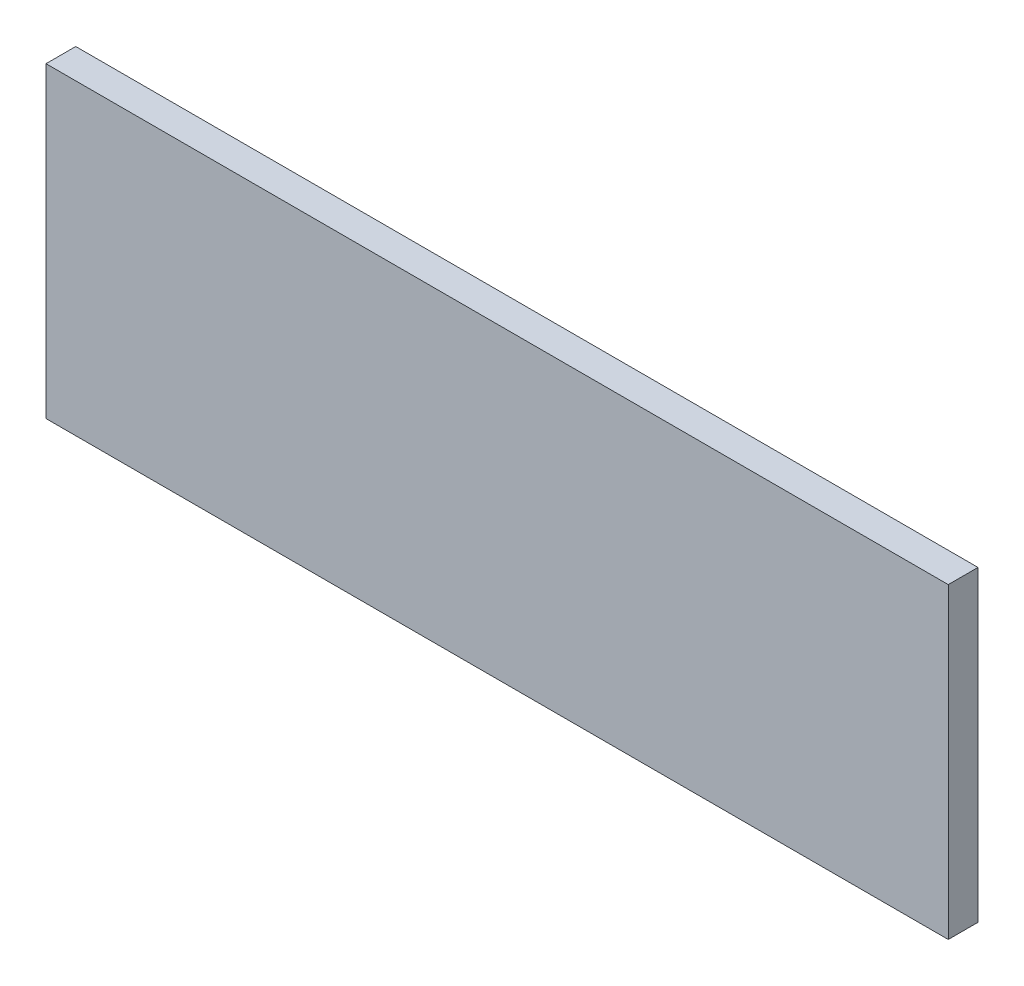
ISO-10303-21;
HEADER;
FILE_DESCRIPTION(('STEP AP214'),'2;1');
FILE_NAME('part.step','',(''),(''),'','','');
FILE_SCHEMA(('AUTOMOTIVE_DESIGN { 1 0 10303 214 1 1 1 1 }'));
ENDSEC;
DATA;
#1=APPLICATION_CONTEXT('core data for automotive mechanical design processes');
#2=APPLICATION_PROTOCOL_DEFINITION('international standard','automotive_design',2000,#1);
#3=PRODUCT_CONTEXT('',#1,'mechanical');
#4=PRODUCT('Part','Part','',(#3));
#5=PRODUCT_RELATED_PRODUCT_CATEGORY('part','',(#4));
#6=PRODUCT_DEFINITION_FORMATION('','',#4);
#7=PRODUCT_DEFINITION_CONTEXT('part definition',#1,'design');
#8=PRODUCT_DEFINITION('design','',#6,#7);
#9=PRODUCT_DEFINITION_SHAPE('','',#8);
#10=(LENGTH_UNIT() NAMED_UNIT(*) SI_UNIT(.MILLI.,.METRE.));
#11=(NAMED_UNIT(*) PLANE_ANGLE_UNIT() SI_UNIT($,.RADIAN.));
#12=(NAMED_UNIT(*) SI_UNIT($,.STERADIAN.) SOLID_ANGLE_UNIT());
#13=UNCERTAINTY_MEASURE_WITH_UNIT(LENGTH_MEASURE(1.E-05),#10,'distance_accuracy_value','');
#14=(GEOMETRIC_REPRESENTATION_CONTEXT(3) GLOBAL_UNCERTAINTY_ASSIGNED_CONTEXT((#13)) GLOBAL_UNIT_ASSIGNED_CONTEXT((#10,
#11,#12)) REPRESENTATION_CONTEXT('',''));
#15=CARTESIAN_POINT('',(0.,0.,0.));
#16=DIRECTION('',(0.,0.,1.));
#17=DIRECTION('',(1.,0.,0.));
#18=AXIS2_PLACEMENT_3D('',#15,#16,#17);
#19=CARTESIAN_POINT('',(45.5,15.5,3.));
#20=DIRECTION('',(-1.,0.,0.));
#21=DIRECTION('',(0.,0.,1.));
#22=AXIS2_PLACEMENT_3D('',#19,#20,#21);
#23=PLANE('',#22);
#24=DIRECTION('',(0.,1.,0.));
#25=VECTOR('',#24,1.);
#26=CARTESIAN_POINT('',(45.5,15.5,0.));
#27=LINE('',#26,#25);
#28=CARTESIAN_POINT('',(45.5,-15.5,0.));
#29=VERTEX_POINT('',#28);
#30=CARTESIAN_POINT('',(45.5,15.5,0.));
#31=VERTEX_POINT('',#30);
#32=EDGE_CURVE('E96',#29,#31,#27,.T.);
#33=ORIENTED_EDGE('',*,*,#32,.T.);
#34=DIRECTION('',(0.,0.,-1.));
#35=VECTOR('',#34,1.);
#36=CARTESIAN_POINT('',(45.5,15.5,3.));
#37=LINE('',#36,#35);
#38=CARTESIAN_POINT('',(45.5,15.5,3.));
#39=VERTEX_POINT('',#38);
#40=EDGE_CURVE('E11',#39,#31,#37,.T.);
#41=ORIENTED_EDGE('',*,*,#40,.F.);
#42=DIRECTION('',(0.,1.,0.));
#43=VECTOR('',#42,1.);
#44=CARTESIAN_POINT('',(45.5,15.5,3.));
#45=LINE('',#44,#43);
#46=CARTESIAN_POINT('',(45.5,-15.5,3.));
#47=VERTEX_POINT('',#46);
#48=EDGE_CURVE('E84',#47,#39,#45,.T.);
#49=ORIENTED_EDGE('',*,*,#48,.F.);
#50=DIRECTION('',(0.,0.,-1.));
#51=VECTOR('',#50,1.);
#52=CARTESIAN_POINT('',(45.5,-15.5,3.));
#53=LINE('',#52,#51);
#54=EDGE_CURVE('E92',#47,#29,#53,.T.);
#55=ORIENTED_EDGE('',*,*,#54,.T.);
#56=EDGE_LOOP('',(#33,#41,#49,#55));
#57=FACE_BOUND('',#56,.T.);
#58=ADVANCED_FACE('F33',(#57),#23,.F.);
#59=CARTESIAN_POINT('',(-45.5,15.5,3.));
#60=DIRECTION('',(0.,-1.,0.));
#61=DIRECTION('',(0.,0.,-1.));
#62=AXIS2_PLACEMENT_3D('',#59,#60,#61);
#63=PLANE('',#62);
#64=DIRECTION('',(-1.,0.,0.));
#65=VECTOR('',#64,1.);
#66=CARTESIAN_POINT('',(-45.5,15.5,0.));
#67=LINE('',#66,#65);
#68=CARTESIAN_POINT('',(-45.5,15.5,0.));
#69=VERTEX_POINT('',#68);
#70=EDGE_CURVE('E88',#31,#69,#67,.T.);
#71=ORIENTED_EDGE('',*,*,#70,.T.);
#72=DIRECTION('',(0.,0.,-1.));
#73=VECTOR('',#72,1.);
#74=CARTESIAN_POINT('',(-45.5,15.5,3.));
#75=LINE('',#74,#73);
#76=CARTESIAN_POINT('',(-45.5,15.5,3.));
#77=VERTEX_POINT('',#76);
#78=EDGE_CURVE('E41',#77,#69,#75,.T.);
#79=ORIENTED_EDGE('',*,*,#78,.F.);
#80=DIRECTION('',(-1.,0.,0.));
#81=VECTOR('',#80,1.);
#82=CARTESIAN_POINT('',(-45.5,15.5,3.));
#83=LINE('',#82,#81);
#84=EDGE_CURVE('E79',#39,#77,#83,.T.);
#85=ORIENTED_EDGE('',*,*,#84,.F.);
#86=ORIENTED_EDGE('',*,*,#40,.T.);
#87=EDGE_LOOP('',(#71,#79,#85,#86));
#88=FACE_BOUND('',#87,.T.);
#89=ADVANCED_FACE('F87',(#88),#63,.F.);
#90=CARTESIAN_POINT('',(-45.5,15.5,3.));
#91=DIRECTION('',(1.,0.,0.));
#92=DIRECTION('',(0.,0.,-1.));
#93=AXIS2_PLACEMENT_3D('',#90,#91,#92);
#94=PLANE('',#93);
#95=DIRECTION('',(0.,-1.,0.));
#96=VECTOR('',#95,1.);
#97=CARTESIAN_POINT('',(-45.5,15.5,0.));
#98=LINE('',#97,#96);
#99=CARTESIAN_POINT('',(-45.5,-15.5,0.));
#100=VERTEX_POINT('',#99);
#101=EDGE_CURVE('E66',#69,#100,#98,.T.);
#102=ORIENTED_EDGE('',*,*,#101,.T.);
#103=DIRECTION('',(0.,0.,-1.));
#104=VECTOR('',#103,1.);
#105=CARTESIAN_POINT('',(-45.5,-15.5,3.));
#106=LINE('',#105,#104);
#107=CARTESIAN_POINT('',(-45.5,-15.5,3.));
#108=VERTEX_POINT('',#107);
#109=EDGE_CURVE('E89',#108,#100,#106,.T.);
#110=ORIENTED_EDGE('',*,*,#109,.F.);
#111=DIRECTION('',(0.,-1.,0.));
#112=VECTOR('',#111,1.);
#113=CARTESIAN_POINT('',(-45.5,15.5,3.));
#114=LINE('',#113,#112);
#115=EDGE_CURVE('E82',#77,#108,#114,.T.);
#116=ORIENTED_EDGE('',*,*,#115,.F.);
#117=ORIENTED_EDGE('',*,*,#78,.T.);
#118=EDGE_LOOP('',(#102,#110,#116,#117));
#119=FACE_BOUND('',#118,.T.);
#120=ADVANCED_FACE('F90',(#119),#94,.F.);
#121=CARTESIAN_POINT('',(-45.5,-15.5,3.));
#122=DIRECTION('',(0.,1.,0.));
#123=DIRECTION('',(0.,0.,1.));
#124=AXIS2_PLACEMENT_3D('',#121,#122,#123);
#125=PLANE('',#124);
#126=DIRECTION('',(1.,0.,0.));
#127=VECTOR('',#126,1.);
#128=CARTESIAN_POINT('',(-45.5,-15.5,0.));
#129=LINE('',#128,#127);
#130=EDGE_CURVE('E72',#100,#29,#129,.T.);
#131=ORIENTED_EDGE('',*,*,#130,.T.);
#132=ORIENTED_EDGE('',*,*,#54,.F.);
#133=DIRECTION('',(1.,0.,0.));
#134=VECTOR('',#133,1.);
#135=CARTESIAN_POINT('',(-45.5,-15.5,3.));
#136=LINE('',#135,#134);
#137=EDGE_CURVE('E49',#108,#47,#136,.T.);
#138=ORIENTED_EDGE('',*,*,#137,.F.);
#139=ORIENTED_EDGE('',*,*,#109,.T.);
#140=EDGE_LOOP('',(#131,#132,#138,#139));
#141=FACE_BOUND('',#140,.T.);
#142=ADVANCED_FACE('F103',(#141),#125,.F.);
#143=CARTESIAN_POINT('',(0.,0.,3.));
#144=DIRECTION('',(0.,0.,1.));
#145=DIRECTION('',(1.,0.,0.));
#146=AXIS2_PLACEMENT_3D('',#143,#144,#145);
#147=PLANE('',#146);
#148=ORIENTED_EDGE('',*,*,#48,.T.);
#149=ORIENTED_EDGE('',*,*,#84,.T.);
#150=ORIENTED_EDGE('',*,*,#115,.T.);
#151=ORIENTED_EDGE('',*,*,#137,.T.);
#152=EDGE_LOOP('',(#148,#149,#150,#151));
#153=FACE_BOUND('',#152,.T.);
#154=ADVANCED_FACE('F80',(#153),#147,.T.);
#155=CARTESIAN_POINT('',(0.,0.,0.));
#156=DIRECTION('',(0.,0.,1.));
#157=DIRECTION('',(1.,0.,0.));
#158=AXIS2_PLACEMENT_3D('',#155,#156,#157);
#159=PLANE('',#158);
#160=ORIENTED_EDGE('',*,*,#32,.F.);
#161=ORIENTED_EDGE('',*,*,#130,.F.);
#162=ORIENTED_EDGE('',*,*,#101,.F.);
#163=ORIENTED_EDGE('',*,*,#70,.F.);
#164=EDGE_LOOP('',(#160,#161,#162,#163));
#165=FACE_BOUND('',#164,.T.);
#166=ADVANCED_FACE('F106',(#165),#159,.F.);
#167=CLOSED_SHELL('',(#58,#89,#120,#142,#154,#166));
#168=MANIFOLD_SOLID_BREP('B2',#167);
#169=ADVANCED_BREP_SHAPE_REPRESENTATION('',(#18,#168),#14);
#170=SHAPE_DEFINITION_REPRESENTATION(#9,#169);
ENDSEC;
END-ISO-10303-21;
